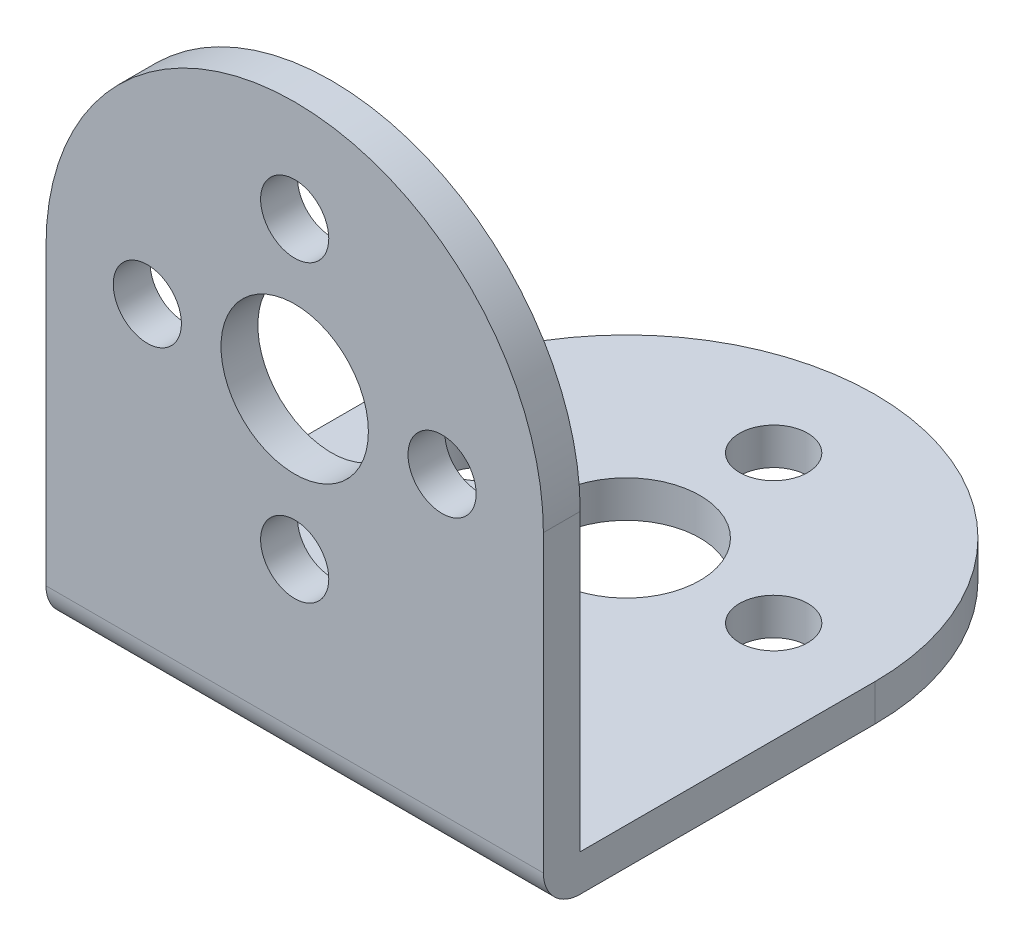
ISO-10303-21;
HEADER;
FILE_DESCRIPTION(('STEP AP214'),'2;1');
FILE_NAME('part.step','',(''),(''),'','','');
FILE_SCHEMA(('AUTOMOTIVE_DESIGN { 1 0 10303 214 1 1 1 1 }'));
ENDSEC;
DATA;
#1=APPLICATION_CONTEXT('core data for automotive mechanical design processes');
#2=APPLICATION_PROTOCOL_DEFINITION('international standard','automotive_design',2000,#1);
#3=PRODUCT_CONTEXT('',#1,'mechanical');
#4=PRODUCT('Part','Part','',(#3));
#5=PRODUCT_RELATED_PRODUCT_CATEGORY('part','',(#4));
#6=PRODUCT_DEFINITION_FORMATION('','',#4);
#7=PRODUCT_DEFINITION_CONTEXT('part definition',#1,'design');
#8=PRODUCT_DEFINITION('design','',#6,#7);
#9=PRODUCT_DEFINITION_SHAPE('','',#8);
#10=(LENGTH_UNIT() NAMED_UNIT(*) SI_UNIT(.MILLI.,.METRE.));
#11=(NAMED_UNIT(*) PLANE_ANGLE_UNIT() SI_UNIT($,.RADIAN.));
#12=(NAMED_UNIT(*) SI_UNIT($,.STERADIAN.) SOLID_ANGLE_UNIT());
#13=UNCERTAINTY_MEASURE_WITH_UNIT(LENGTH_MEASURE(1.E-05),#10,'distance_accuracy_value','');
#14=(GEOMETRIC_REPRESENTATION_CONTEXT(3) GLOBAL_UNCERTAINTY_ASSIGNED_CONTEXT((#13)) GLOBAL_UNIT_ASSIGNED_CONTEXT((#10,
#11,#12)) REPRESENTATION_CONTEXT('',''));
#15=CARTESIAN_POINT('',(0.,0.,0.));
#16=DIRECTION('',(0.,0.,1.));
#17=DIRECTION('',(1.,0.,0.));
#18=AXIS2_PLACEMENT_3D('',#15,#16,#17);
#19=CARTESIAN_POINT('',(0.,0.,-18.));
#20=DIRECTION('',(0.,1.,0.));
#21=DIRECTION('',(0.,0.,1.));
#22=AXIS2_PLACEMENT_3D('',#19,#20,#21);
#23=CYLINDRICAL_SURFACE('',#22,4.);
#24=CARTESIAN_POINT('',(0.,0.,-18.));
#25=DIRECTION('',(0.,1.,0.));
#26=DIRECTION('',(0.,0.,1.));
#27=AXIS2_PLACEMENT_3D('',#24,#25,#26);
#28=CIRCLE('',#27,4.);
#29=CARTESIAN_POINT('',(0.,0.,-14.));
#30=VERTEX_POINT('',#29);
#31=EDGE_CURVE('E20',#30,#30,#28,.T.);
#32=ORIENTED_EDGE('',*,*,#31,.F.);
#33=EDGE_LOOP('',(#32));
#34=FACE_BOUND('',#33,.T.);
#35=CARTESIAN_POINT('',(0.,2.,-18.));
#36=DIRECTION('',(0.,1.,0.));
#37=DIRECTION('',(0.,0.,1.));
#38=AXIS2_PLACEMENT_3D('',#35,#36,#37);
#39=CIRCLE('',#38,4.);
#40=CARTESIAN_POINT('',(0.,2.,-14.));
#41=VERTEX_POINT('',#40);
#42=EDGE_CURVE('E161',#41,#41,#39,.F.);
#43=ORIENTED_EDGE('',*,*,#42,.F.);
#44=EDGE_LOOP('',(#43));
#45=FACE_BOUND('',#44,.T.);
#46=ADVANCED_FACE('F17',(#34,#45),#23,.F.);
#47=CARTESIAN_POINT('',(0.,0.,-26.));
#48=DIRECTION('',(0.,1.,0.));
#49=DIRECTION('',(0.,0.,1.));
#50=AXIS2_PLACEMENT_3D('',#47,#48,#49);
#51=CYLINDRICAL_SURFACE('',#50,1.85);
#52=CARTESIAN_POINT('',(0.,0.,-26.));
#53=DIRECTION('',(0.,1.,0.));
#54=DIRECTION('',(0.,0.,1.));
#55=AXIS2_PLACEMENT_3D('',#52,#53,#54);
#56=CIRCLE('',#55,1.85);
#57=CARTESIAN_POINT('',(0.,0.,-24.15));
#58=VERTEX_POINT('',#57);
#59=EDGE_CURVE('E174',#58,#58,#56,.T.);
#60=ORIENTED_EDGE('',*,*,#59,.F.);
#61=EDGE_LOOP('',(#60));
#62=FACE_BOUND('',#61,.T.);
#63=CARTESIAN_POINT('',(0.,2.,-26.));
#64=DIRECTION('',(0.,1.,0.));
#65=DIRECTION('',(0.,0.,1.));
#66=AXIS2_PLACEMENT_3D('',#63,#64,#65);
#67=CIRCLE('',#66,1.85);
#68=CARTESIAN_POINT('',(0.,2.,-24.15));
#69=VERTEX_POINT('',#68);
#70=EDGE_CURVE('E158',#69,#69,#67,.F.);
#71=ORIENTED_EDGE('',*,*,#70,.F.);
#72=EDGE_LOOP('',(#71));
#73=FACE_BOUND('',#72,.T.);
#74=ADVANCED_FACE('F184',(#62,#73),#51,.F.);
#75=CARTESIAN_POINT('',(8.,0.,-18.));
#76=DIRECTION('',(0.,1.,0.));
#77=DIRECTION('',(0.,0.,1.));
#78=AXIS2_PLACEMENT_3D('',#75,#76,#77);
#79=CYLINDRICAL_SURFACE('',#78,1.85);
#80=CARTESIAN_POINT('',(8.,0.,-18.));
#81=DIRECTION('',(0.,1.,0.));
#82=DIRECTION('',(0.,0.,1.));
#83=AXIS2_PLACEMENT_3D('',#80,#81,#82);
#84=CIRCLE('',#83,1.85);
#85=CARTESIAN_POINT('',(8.,0.,-16.15));
#86=VERTEX_POINT('',#85);
#87=EDGE_CURVE('E172',#86,#86,#84,.T.);
#88=ORIENTED_EDGE('',*,*,#87,.F.);
#89=EDGE_LOOP('',(#88));
#90=FACE_BOUND('',#89,.T.);
#91=CARTESIAN_POINT('',(8.,2.,-18.));
#92=DIRECTION('',(0.,1.,0.));
#93=DIRECTION('',(0.,0.,1.));
#94=AXIS2_PLACEMENT_3D('',#91,#92,#93);
#95=CIRCLE('',#94,1.85);
#96=CARTESIAN_POINT('',(8.,2.,-16.15));
#97=VERTEX_POINT('',#96);
#98=EDGE_CURVE('E155',#97,#97,#95,.F.);
#99=ORIENTED_EDGE('',*,*,#98,.F.);
#100=EDGE_LOOP('',(#99));
#101=FACE_BOUND('',#100,.T.);
#102=ADVANCED_FACE('F366',(#90,#101),#79,.F.);
#103=CARTESIAN_POINT('',(0.,0.,-10.));
#104=DIRECTION('',(0.,1.,0.));
#105=DIRECTION('',(0.,0.,1.));
#106=AXIS2_PLACEMENT_3D('',#103,#104,#105);
#107=CYLINDRICAL_SURFACE('',#106,1.85);
#108=CARTESIAN_POINT('',(0.,0.,-10.));
#109=DIRECTION('',(0.,1.,0.));
#110=DIRECTION('',(0.,0.,1.));
#111=AXIS2_PLACEMENT_3D('',#108,#109,#110);
#112=CIRCLE('',#111,1.85);
#113=CARTESIAN_POINT('',(0.,0.,-8.15));
#114=VERTEX_POINT('',#113);
#115=EDGE_CURVE('E169',#114,#114,#112,.T.);
#116=ORIENTED_EDGE('',*,*,#115,.F.);
#117=EDGE_LOOP('',(#116));
#118=FACE_BOUND('',#117,.T.);
#119=CARTESIAN_POINT('',(0.,2.,-10.));
#120=DIRECTION('',(0.,1.,0.));
#121=DIRECTION('',(0.,0.,1.));
#122=AXIS2_PLACEMENT_3D('',#119,#120,#121);
#123=CIRCLE('',#122,1.85);
#124=CARTESIAN_POINT('',(0.,2.,-8.15));
#125=VERTEX_POINT('',#124);
#126=EDGE_CURVE('E152',#125,#125,#123,.F.);
#127=ORIENTED_EDGE('',*,*,#126,.F.);
#128=EDGE_LOOP('',(#127));
#129=FACE_BOUND('',#128,.T.);
#130=ADVANCED_FACE('F357',(#118,#129),#107,.F.);
#131=CARTESIAN_POINT('',(-8.,0.,-18.));
#132=DIRECTION('',(0.,1.,0.));
#133=DIRECTION('',(0.,0.,1.));
#134=AXIS2_PLACEMENT_3D('',#131,#132,#133);
#135=CYLINDRICAL_SURFACE('',#134,1.85);
#136=CARTESIAN_POINT('',(-8.,0.,-18.));
#137=DIRECTION('',(0.,1.,0.));
#138=DIRECTION('',(0.,0.,1.));
#139=AXIS2_PLACEMENT_3D('',#136,#137,#138);
#140=CIRCLE('',#139,1.85);
#141=CARTESIAN_POINT('',(-8.,0.,-16.15));
#142=VERTEX_POINT('',#141);
#143=EDGE_CURVE('E86',#142,#142,#140,.T.);
#144=ORIENTED_EDGE('',*,*,#143,.F.);
#145=EDGE_LOOP('',(#144));
#146=FACE_BOUND('',#145,.T.);
#147=CARTESIAN_POINT('',(-8.,2.,-18.));
#148=DIRECTION('',(0.,1.,0.));
#149=DIRECTION('',(0.,0.,1.));
#150=AXIS2_PLACEMENT_3D('',#147,#148,#149);
#151=CIRCLE('',#150,1.85);
#152=CARTESIAN_POINT('',(-8.,2.,-16.15));
#153=VERTEX_POINT('',#152);
#154=EDGE_CURVE('E149',#153,#153,#151,.F.);
#155=ORIENTED_EDGE('',*,*,#154,.F.);
#156=EDGE_LOOP('',(#155));
#157=FACE_BOUND('',#156,.T.);
#158=ADVANCED_FACE('F348',(#146,#157),#135,.F.);
#159=CARTESIAN_POINT('',(-13.5,0.,0.));
#160=DIRECTION('',(0.,-1.,0.));
#161=DIRECTION('',(0.,0.,-1.));
#162=AXIS2_PLACEMENT_3D('',#159,#160,#161);
#163=PLANE('',#162);
#164=ORIENTED_EDGE('',*,*,#143,.T.);
#165=EDGE_LOOP('',(#164));
#166=FACE_BOUND('',#165,.T.);
#167=ORIENTED_EDGE('',*,*,#115,.T.);
#168=EDGE_LOOP('',(#167));
#169=FACE_BOUND('',#168,.T.);
#170=ORIENTED_EDGE('',*,*,#87,.T.);
#171=EDGE_LOOP('',(#170));
#172=FACE_BOUND('',#171,.T.);
#173=ORIENTED_EDGE('',*,*,#59,.T.);
#174=EDGE_LOOP('',(#173));
#175=FACE_BOUND('',#174,.T.);
#176=ORIENTED_EDGE('',*,*,#31,.T.);
#177=EDGE_LOOP('',(#176));
#178=FACE_BOUND('',#177,.T.);
#179=CARTESIAN_POINT('',(0.,0.,-18.));
#180=DIRECTION('',(0.,1.,0.));
#181=DIRECTION('',(0.,0.,1.));
#182=AXIS2_PLACEMENT_3D('',#179,#180,#181);
#183=CIRCLE('',#182,13.5);
#184=CARTESIAN_POINT('',(13.5,0.,-18.));
#185=VERTEX_POINT('',#184);
#186=CARTESIAN_POINT('',(-13.5,0.,-18.));
#187=VERTEX_POINT('',#186);
#188=EDGE_CURVE('E75',#185,#187,#183,.T.);
#189=ORIENTED_EDGE('',*,*,#188,.F.);
#190=DIRECTION('',(0.,0.,-1.));
#191=VECTOR('',#190,1.);
#192=CARTESIAN_POINT('',(13.5,0.,0.));
#193=LINE('',#192,#191);
#194=CARTESIAN_POINT('',(13.5,0.,-2.));
#195=VERTEX_POINT('',#194);
#196=EDGE_CURVE('E79',#195,#185,#193,.T.);
#197=ORIENTED_EDGE('',*,*,#196,.F.);
#198=DIRECTION('',(-1.,0.,0.));
#199=VECTOR('',#198,1.);
#200=CARTESIAN_POINT('',(48.6972,0.,-2.));
#201=LINE('',#200,#199);
#202=CARTESIAN_POINT('',(-13.5,0.,-2.));
#203=VERTEX_POINT('',#202);
#204=EDGE_CURVE('E85',#203,#195,#201,.F.);
#205=ORIENTED_EDGE('',*,*,#204,.F.);
#206=DIRECTION('',(0.,0.,-1.));
#207=VECTOR('',#206,1.);
#208=CARTESIAN_POINT('',(-13.5,0.,0.));
#209=LINE('',#208,#207);
#210=EDGE_CURVE('E82',#203,#187,#209,.T.);
#211=ORIENTED_EDGE('',*,*,#210,.T.);
#212=EDGE_LOOP('',(#189,#197,#205,#211));
#213=FACE_BOUND('',#212,.T.);
#214=ADVANCED_FACE('F77',(#166,#169,#172,#175,#178,#213),#163,.T.);
#215=CARTESIAN_POINT('',(0.,-41.0634,-18.));
#216=DIRECTION('',(0.,1.,0.));
#217=DIRECTION('',(0.,0.,1.));
#218=AXIS2_PLACEMENT_3D('',#215,#216,#217);
#219=CYLINDRICAL_SURFACE('',#218,13.5);
#220=ORIENTED_EDGE('',*,*,#188,.T.);
#221=DIRECTION('',(0.,1.,0.));
#222=VECTOR('',#221,1.);
#223=CARTESIAN_POINT('',(-13.5,0.,-18.));
#224=LINE('',#223,#222);
#225=CARTESIAN_POINT('',(-13.5,2.,-18.));
#226=VERTEX_POINT('',#225);
#227=EDGE_CURVE('E112',#187,#226,#224,.T.);
#228=ORIENTED_EDGE('',*,*,#227,.T.);
#229=CARTESIAN_POINT('',(0.,2.,-18.));
#230=DIRECTION('',(0.,1.,0.));
#231=DIRECTION('',(0.,0.,1.));
#232=AXIS2_PLACEMENT_3D('',#229,#230,#231);
#233=CIRCLE('',#232,13.5);
#234=CARTESIAN_POINT('',(13.5,2.,-18.));
#235=VERTEX_POINT('',#234);
#236=EDGE_CURVE('E91',#235,#226,#233,.T.);
#237=ORIENTED_EDGE('',*,*,#236,.F.);
#238=DIRECTION('',(0.,1.,0.));
#239=VECTOR('',#238,1.);
#240=CARTESIAN_POINT('',(13.5,0.,-18.));
#241=LINE('',#240,#239);
#242=EDGE_CURVE('E89',#185,#235,#241,.T.);
#243=ORIENTED_EDGE('',*,*,#242,.F.);
#244=EDGE_LOOP('',(#220,#228,#237,#243));
#245=FACE_BOUND('',#244,.T.);
#246=ADVANCED_FACE('F90',(#245),#219,.T.);
#247=CARTESIAN_POINT('',(48.6972,2.,-2.));
#248=DIRECTION('',(-1.,0.,0.));
#249=DIRECTION('',(0.,0.,1.));
#250=AXIS2_PLACEMENT_3D('',#247,#248,#249);
#251=CYLINDRICAL_SURFACE('',#250,2.);
#252=CARTESIAN_POINT('',(13.5,2.,-2.));
#253=DIRECTION('',(-1.,0.,0.));
#254=DIRECTION('',(0.,0.,1.));
#255=AXIS2_PLACEMENT_3D('',#252,#253,#254);
#256=CIRCLE('',#255,2.);
#257=CARTESIAN_POINT('',(13.5,2.,0.));
#258=VERTEX_POINT('',#257);
#259=EDGE_CURVE('E99',#258,#195,#256,.F.);
#260=ORIENTED_EDGE('',*,*,#259,.F.);
#261=DIRECTION('',(1.,0.,0.));
#262=VECTOR('',#261,1.);
#263=CARTESIAN_POINT('',(-13.5,2.,0.));
#264=LINE('',#263,#262);
#265=CARTESIAN_POINT('',(-13.5,2.,0.));
#266=VERTEX_POINT('',#265);
#267=EDGE_CURVE('E109',#266,#258,#264,.T.);
#268=ORIENTED_EDGE('',*,*,#267,.F.);
#269=CARTESIAN_POINT('',(-13.5,2.,-2.));
#270=DIRECTION('',(-1.,0.,0.));
#271=DIRECTION('',(0.,0.,1.));
#272=AXIS2_PLACEMENT_3D('',#269,#270,#271);
#273=CIRCLE('',#272,2.);
#274=EDGE_CURVE('E145',#266,#203,#273,.F.);
#275=ORIENTED_EDGE('',*,*,#274,.T.);
#276=ORIENTED_EDGE('',*,*,#204,.T.);
#277=EDGE_LOOP('',(#260,#268,#275,#276));
#278=FACE_BOUND('',#277,.T.);
#279=ADVANCED_FACE('F219',(#278),#251,.T.);
#280=CARTESIAN_POINT('',(-13.5,31.5,0.));
#281=DIRECTION('',(0.,0.,1.));
#282=DIRECTION('',(1.,0.,0.));
#283=AXIS2_PLACEMENT_3D('',#280,#281,#282);
#284=PLANE('',#283);
#285=CARTESIAN_POINT('',(-8.,18.,0.));
#286=DIRECTION('',(0.,0.,1.));
#287=DIRECTION('',(1.,0.,0.));
#288=AXIS2_PLACEMENT_3D('',#285,#286,#287);
#289=CIRCLE('',#288,1.85);
#290=CARTESIAN_POINT('',(-6.15,18.,0.));
#291=VERTEX_POINT('',#290);
#292=EDGE_CURVE('E130',#291,#291,#289,.F.);
#293=ORIENTED_EDGE('',*,*,#292,.T.);
#294=EDGE_LOOP('',(#293));
#295=FACE_BOUND('',#294,.T.);
#296=CARTESIAN_POINT('',(0.,10.,0.));
#297=DIRECTION('',(0.,0.,1.));
#298=DIRECTION('',(1.,0.,0.));
#299=AXIS2_PLACEMENT_3D('',#296,#297,#298);
#300=CIRCLE('',#299,1.85);
#301=CARTESIAN_POINT('',(1.85,10.,0.));
#302=VERTEX_POINT('',#301);
#303=EDGE_CURVE('E133',#302,#302,#300,.F.);
#304=ORIENTED_EDGE('',*,*,#303,.T.);
#305=EDGE_LOOP('',(#304));
#306=FACE_BOUND('',#305,.T.);
#307=CARTESIAN_POINT('',(8.,18.,0.));
#308=DIRECTION('',(0.,0.,1.));
#309=DIRECTION('',(1.,0.,0.));
#310=AXIS2_PLACEMENT_3D('',#307,#308,#309);
#311=CIRCLE('',#310,1.85);
#312=CARTESIAN_POINT('',(9.85,18.,0.));
#313=VERTEX_POINT('',#312);
#314=EDGE_CURVE('E136',#313,#313,#311,.F.);
#315=ORIENTED_EDGE('',*,*,#314,.T.);
#316=EDGE_LOOP('',(#315));
#317=FACE_BOUND('',#316,.T.);
#318=CARTESIAN_POINT('',(0.,26.,0.));
#319=DIRECTION('',(0.,0.,1.));
#320=DIRECTION('',(1.,0.,0.));
#321=AXIS2_PLACEMENT_3D('',#318,#319,#320);
#322=CIRCLE('',#321,1.85);
#323=CARTESIAN_POINT('',(1.85,26.,0.));
#324=VERTEX_POINT('',#323);
#325=EDGE_CURVE('E139',#324,#324,#322,.F.);
#326=ORIENTED_EDGE('',*,*,#325,.T.);
#327=EDGE_LOOP('',(#326));
#328=FACE_BOUND('',#327,.T.);
#329=CARTESIAN_POINT('',(0.,18.,0.));
#330=DIRECTION('',(0.,0.,1.));
#331=DIRECTION('',(1.,0.,0.));
#332=AXIS2_PLACEMENT_3D('',#329,#330,#331);
#333=CIRCLE('',#332,4.);
#334=CARTESIAN_POINT('',(4.,18.,0.));
#335=VERTEX_POINT('',#334);
#336=EDGE_CURVE('E142',#335,#335,#333,.F.);
#337=ORIENTED_EDGE('',*,*,#336,.T.);
#338=EDGE_LOOP('',(#337));
#339=FACE_BOUND('',#338,.T.);
#340=CARTESIAN_POINT('',(0.,18.,0.));
#341=DIRECTION('',(0.,0.,1.));
#342=DIRECTION('',(1.,0.,0.));
#343=AXIS2_PLACEMENT_3D('',#340,#341,#342);
#344=CIRCLE('',#343,13.5);
#345=CARTESIAN_POINT('',(-13.5,18.,0.));
#346=VERTEX_POINT('',#345);
#347=CARTESIAN_POINT('',(13.5,18.,0.));
#348=VERTEX_POINT('',#347);
#349=EDGE_CURVE('E101',#346,#348,#344,.F.);
#350=ORIENTED_EDGE('',*,*,#349,.F.);
#351=DIRECTION('',(0.,1.,0.));
#352=VECTOR('',#351,1.);
#353=CARTESIAN_POINT('',(-13.5,0.,0.));
#354=LINE('',#353,#352);
#355=EDGE_CURVE('E148',#346,#266,#354,.F.);
#356=ORIENTED_EDGE('',*,*,#355,.T.);
#357=ORIENTED_EDGE('',*,*,#267,.T.);
#358=DIRECTION('',(0.,1.,0.));
#359=VECTOR('',#358,1.);
#360=CARTESIAN_POINT('',(13.5,0.,0.));
#361=LINE('',#360,#359);
#362=EDGE_CURVE('E105',#348,#258,#361,.F.);
#363=ORIENTED_EDGE('',*,*,#362,.F.);
#364=EDGE_LOOP('',(#350,#356,#357,#363));
#365=FACE_BOUND('',#364,.T.);
#366=ADVANCED_FACE('F217',(#295,#306,#317,#328,#339,#365),#284,.T.);
#367=CARTESIAN_POINT('',(0.,18.,-72.5634));
#368=DIRECTION('',(0.,0.,1.));
#369=DIRECTION('',(1.,0.,0.));
#370=AXIS2_PLACEMENT_3D('',#367,#368,#369);
#371=CYLINDRICAL_SURFACE('',#370,13.5);
#372=CARTESIAN_POINT('',(0.,18.,-2.));
#373=DIRECTION('',(0.,0.,1.));
#374=DIRECTION('',(1.,0.,0.));
#375=AXIS2_PLACEMENT_3D('',#372,#373,#374);
#376=CIRCLE('',#375,13.5);
#377=CARTESIAN_POINT('',(-13.5,18.,-2.));
#378=VERTEX_POINT('',#377);
#379=CARTESIAN_POINT('',(13.5,18.,-2.));
#380=VERTEX_POINT('',#379);
#381=EDGE_CURVE('E126',#378,#380,#376,.F.);
#382=ORIENTED_EDGE('',*,*,#381,.F.);
#383=DIRECTION('',(0.,0.,-1.));
#384=VECTOR('',#383,1.);
#385=CARTESIAN_POINT('',(-13.5,18.,0.));
#386=LINE('',#385,#384);
#387=EDGE_CURVE('E205',#378,#346,#386,.F.);
#388=ORIENTED_EDGE('',*,*,#387,.T.);
#389=ORIENTED_EDGE('',*,*,#349,.T.);
#390=DIRECTION('',(0.,0.,-1.));
#391=VECTOR('',#390,1.);
#392=CARTESIAN_POINT('',(13.5,18.,0.));
#393=LINE('',#392,#391);
#394=EDGE_CURVE('E94',#380,#348,#393,.F.);
#395=ORIENTED_EDGE('',*,*,#394,.F.);
#396=EDGE_LOOP('',(#382,#388,#389,#395));
#397=FACE_BOUND('',#396,.T.);
#398=ADVANCED_FACE('F212',(#397),#371,.T.);
#399=CARTESIAN_POINT('',(13.5,0.,0.));
#400=DIRECTION('',(1.,0.,0.));
#401=DIRECTION('',(0.,0.,-1.));
#402=AXIS2_PLACEMENT_3D('',#399,#400,#401);
#403=PLANE('',#402);
#404=ORIENTED_EDGE('',*,*,#394,.T.);
#405=ORIENTED_EDGE('',*,*,#362,.T.);
#406=ORIENTED_EDGE('',*,*,#259,.T.);
#407=ORIENTED_EDGE('',*,*,#196,.T.);
#408=ORIENTED_EDGE('',*,*,#242,.T.);
#409=DIRECTION('',(0.,0.,1.));
#410=VECTOR('',#409,1.);
#411=CARTESIAN_POINT('',(13.5,2.,-31.5));
#412=LINE('',#411,#410);
#413=CARTESIAN_POINT('',(13.5,2.,-2.));
#414=VERTEX_POINT('',#413);
#415=EDGE_CURVE('E164',#414,#235,#412,.F.);
#416=ORIENTED_EDGE('',*,*,#415,.F.);
#417=DIRECTION('',(0.,1.,0.));
#418=VECTOR('',#417,1.);
#419=CARTESIAN_POINT('',(13.5,2.,-2.));
#420=LINE('',#419,#418);
#421=EDGE_CURVE('E129',#380,#414,#420,.F.);
#422=ORIENTED_EDGE('',*,*,#421,.F.);
#423=EDGE_LOOP('',(#404,#405,#406,#407,#408,#416,#422));
#424=FACE_BOUND('',#423,.T.);
#425=ADVANCED_FACE('F97',(#424),#403,.T.);
#426=CARTESIAN_POINT('',(-13.5,2.,-31.5));
#427=DIRECTION('',(0.,1.,0.));
#428=DIRECTION('',(0.,0.,1.));
#429=AXIS2_PLACEMENT_3D('',#426,#427,#428);
#430=PLANE('',#429);
#431=ORIENTED_EDGE('',*,*,#154,.T.);
#432=EDGE_LOOP('',(#431));
#433=FACE_BOUND('',#432,.T.);
#434=ORIENTED_EDGE('',*,*,#126,.T.);
#435=EDGE_LOOP('',(#434));
#436=FACE_BOUND('',#435,.T.);
#437=ORIENTED_EDGE('',*,*,#98,.T.);
#438=EDGE_LOOP('',(#437));
#439=FACE_BOUND('',#438,.T.);
#440=ORIENTED_EDGE('',*,*,#70,.T.);
#441=EDGE_LOOP('',(#440));
#442=FACE_BOUND('',#441,.T.);
#443=ORIENTED_EDGE('',*,*,#42,.T.);
#444=EDGE_LOOP('',(#443));
#445=FACE_BOUND('',#444,.T.);
#446=DIRECTION('',(-1.,0.,0.));
#447=VECTOR('',#446,1.);
#448=CARTESIAN_POINT('',(-13.5,2.,-2.));
#449=LINE('',#448,#447);
#450=CARTESIAN_POINT('',(-13.5,2.,-2.));
#451=VERTEX_POINT('',#450);
#452=EDGE_CURVE('E193',#414,#451,#449,.T.);
#453=ORIENTED_EDGE('',*,*,#452,.F.);
#454=ORIENTED_EDGE('',*,*,#415,.T.);
#455=ORIENTED_EDGE('',*,*,#236,.T.);
#456=DIRECTION('',(0.,0.,-1.));
#457=VECTOR('',#456,1.);
#458=CARTESIAN_POINT('',(-13.5,2.,0.));
#459=LINE('',#458,#457);
#460=EDGE_CURVE('E35',#226,#451,#459,.F.);
#461=ORIENTED_EDGE('',*,*,#460,.T.);
#462=EDGE_LOOP('',(#453,#454,#455,#461));
#463=FACE_BOUND('',#462,.T.);
#464=ADVANCED_FACE('F187',(#433,#436,#439,#442,#445,#463),#430,.T.);
#465=CARTESIAN_POINT('',(-13.5,0.,0.));
#466=DIRECTION('',(1.,0.,0.));
#467=DIRECTION('',(0.,0.,-1.));
#468=AXIS2_PLACEMENT_3D('',#465,#466,#467);
#469=PLANE('',#468);
#470=ORIENTED_EDGE('',*,*,#355,.F.);
#471=ORIENTED_EDGE('',*,*,#387,.F.);
#472=DIRECTION('',(0.,1.,0.));
#473=VECTOR('',#472,1.);
#474=CARTESIAN_POINT('',(-13.5,2.,-2.));
#475=LINE('',#474,#473);
#476=EDGE_CURVE('E125',#451,#378,#475,.T.);
#477=ORIENTED_EDGE('',*,*,#476,.F.);
#478=ORIENTED_EDGE('',*,*,#460,.F.);
#479=ORIENTED_EDGE('',*,*,#227,.F.);
#480=ORIENTED_EDGE('',*,*,#210,.F.);
#481=ORIENTED_EDGE('',*,*,#274,.F.);
#482=EDGE_LOOP('',(#470,#471,#477,#478,#479,#480,#481));
#483=FACE_BOUND('',#482,.T.);
#484=ADVANCED_FACE('F189',(#483),#469,.F.);
#485=CARTESIAN_POINT('',(0.,18.,0.));
#486=DIRECTION('',(0.,0.,1.));
#487=DIRECTION('',(1.,0.,0.));
#488=AXIS2_PLACEMENT_3D('',#485,#486,#487);
#489=CYLINDRICAL_SURFACE('',#488,4.);
#490=CARTESIAN_POINT('',(0.,18.,-2.));
#491=DIRECTION('',(0.,0.,1.));
#492=DIRECTION('',(1.,0.,0.));
#493=AXIS2_PLACEMENT_3D('',#490,#491,#492);
#494=CIRCLE('',#493,4.);
#495=CARTESIAN_POINT('',(4.,18.,-2.));
#496=VERTEX_POINT('',#495);
#497=EDGE_CURVE('E122',#496,#496,#494,.T.);
#498=ORIENTED_EDGE('',*,*,#497,.F.);
#499=EDGE_LOOP('',(#498));
#500=FACE_BOUND('',#499,.T.);
#501=ORIENTED_EDGE('',*,*,#336,.F.);
#502=EDGE_LOOP('',(#501));
#503=FACE_BOUND('',#502,.T.);
#504=ADVANCED_FACE('F252',(#500,#503),#489,.F.);
#505=CARTESIAN_POINT('',(0.,26.,0.));
#506=DIRECTION('',(0.,0.,1.));
#507=DIRECTION('',(1.,0.,0.));
#508=AXIS2_PLACEMENT_3D('',#505,#506,#507);
#509=CYLINDRICAL_SURFACE('',#508,1.85);
#510=CARTESIAN_POINT('',(0.,26.,-2.));
#511=DIRECTION('',(0.,0.,1.));
#512=DIRECTION('',(1.,0.,0.));
#513=AXIS2_PLACEMENT_3D('',#510,#511,#512);
#514=CIRCLE('',#513,1.85);
#515=CARTESIAN_POINT('',(1.85,26.,-2.));
#516=VERTEX_POINT('',#515);
#517=EDGE_CURVE('E119',#516,#516,#514,.T.);
#518=ORIENTED_EDGE('',*,*,#517,.F.);
#519=EDGE_LOOP('',(#518));
#520=FACE_BOUND('',#519,.T.);
#521=ORIENTED_EDGE('',*,*,#325,.F.);
#522=EDGE_LOOP('',(#521));
#523=FACE_BOUND('',#522,.T.);
#524=ADVANCED_FACE('F248',(#520,#523),#509,.F.);
#525=CARTESIAN_POINT('',(8.,18.,0.));
#526=DIRECTION('',(0.,0.,1.));
#527=DIRECTION('',(1.,0.,0.));
#528=AXIS2_PLACEMENT_3D('',#525,#526,#527);
#529=CYLINDRICAL_SURFACE('',#528,1.85);
#530=CARTESIAN_POINT('',(8.,18.,-2.));
#531=DIRECTION('',(0.,0.,1.));
#532=DIRECTION('',(1.,0.,0.));
#533=AXIS2_PLACEMENT_3D('',#530,#531,#532);
#534=CIRCLE('',#533,1.85);
#535=CARTESIAN_POINT('',(9.85,18.,-2.));
#536=VERTEX_POINT('',#535);
#537=EDGE_CURVE('E116',#536,#536,#534,.T.);
#538=ORIENTED_EDGE('',*,*,#537,.F.);
#539=EDGE_LOOP('',(#538));
#540=FACE_BOUND('',#539,.T.);
#541=ORIENTED_EDGE('',*,*,#314,.F.);
#542=EDGE_LOOP('',(#541));
#543=FACE_BOUND('',#542,.T.);
#544=ADVANCED_FACE('F244',(#540,#543),#529,.F.);
#545=CARTESIAN_POINT('',(0.,10.,0.));
#546=DIRECTION('',(0.,0.,1.));
#547=DIRECTION('',(1.,0.,0.));
#548=AXIS2_PLACEMENT_3D('',#545,#546,#547);
#549=CYLINDRICAL_SURFACE('',#548,1.85);
#550=CARTESIAN_POINT('',(0.,10.,-2.));
#551=DIRECTION('',(0.,0.,1.));
#552=DIRECTION('',(1.,0.,0.));
#553=AXIS2_PLACEMENT_3D('',#550,#551,#552);
#554=CIRCLE('',#553,1.85);
#555=CARTESIAN_POINT('',(1.85,10.,-2.));
#556=VERTEX_POINT('',#555);
#557=EDGE_CURVE('E26',#556,#556,#554,.T.);
#558=ORIENTED_EDGE('',*,*,#557,.F.);
#559=EDGE_LOOP('',(#558));
#560=FACE_BOUND('',#559,.T.);
#561=ORIENTED_EDGE('',*,*,#303,.F.);
#562=EDGE_LOOP('',(#561));
#563=FACE_BOUND('',#562,.T.);
#564=ADVANCED_FACE('F237',(#560,#563),#549,.F.);
#565=CARTESIAN_POINT('',(-8.,18.,0.));
#566=DIRECTION('',(0.,0.,1.));
#567=DIRECTION('',(1.,0.,0.));
#568=AXIS2_PLACEMENT_3D('',#565,#566,#567);
#569=CYLINDRICAL_SURFACE('',#568,1.85);
#570=CARTESIAN_POINT('',(-8.,18.,-2.));
#571=DIRECTION('',(0.,0.,1.));
#572=DIRECTION('',(1.,0.,0.));
#573=AXIS2_PLACEMENT_3D('',#570,#571,#572);
#574=CIRCLE('',#573,1.85);
#575=CARTESIAN_POINT('',(-6.15,18.,-2.));
#576=VERTEX_POINT('',#575);
#577=EDGE_CURVE('E10',#576,#576,#574,.T.);
#578=ORIENTED_EDGE('',*,*,#577,.F.);
#579=EDGE_LOOP('',(#578));
#580=FACE_BOUND('',#579,.T.);
#581=ORIENTED_EDGE('',*,*,#292,.F.);
#582=EDGE_LOOP('',(#581));
#583=FACE_BOUND('',#582,.T.);
#584=ADVANCED_FACE('F231',(#580,#583),#569,.F.);
#585=CARTESIAN_POINT('',(-13.5,2.,-2.));
#586=DIRECTION('',(0.,0.,-1.));
#587=DIRECTION('',(-1.,0.,0.));
#588=AXIS2_PLACEMENT_3D('',#585,#586,#587);
#589=PLANE('',#588);
#590=ORIENTED_EDGE('',*,*,#577,.T.);
#591=EDGE_LOOP('',(#590));
#592=FACE_BOUND('',#591,.T.);
#593=ORIENTED_EDGE('',*,*,#557,.T.);
#594=EDGE_LOOP('',(#593));
#595=FACE_BOUND('',#594,.T.);
#596=ORIENTED_EDGE('',*,*,#537,.T.);
#597=EDGE_LOOP('',(#596));
#598=FACE_BOUND('',#597,.T.);
#599=ORIENTED_EDGE('',*,*,#517,.T.);
#600=EDGE_LOOP('',(#599));
#601=FACE_BOUND('',#600,.T.);
#602=ORIENTED_EDGE('',*,*,#497,.T.);
#603=EDGE_LOOP('',(#602));
#604=FACE_BOUND('',#603,.T.);
#605=ORIENTED_EDGE('',*,*,#452,.T.);
#606=ORIENTED_EDGE('',*,*,#476,.T.);
#607=ORIENTED_EDGE('',*,*,#381,.T.);
#608=ORIENTED_EDGE('',*,*,#421,.T.);
#609=EDGE_LOOP('',(#605,#606,#607,#608));
#610=FACE_BOUND('',#609,.T.);
#611=ADVANCED_FACE('F199',(#592,#595,#598,#601,#604,#610),#589,.T.);
#612=CLOSED_SHELL('',(#46,#74,#102,#130,#158,#214,#246,#279,#366,#398,#425,#464,#484,#504,#524,
#544,#564,#584,#611));
#613=MANIFOLD_SOLID_BREP('B1',#612);
#614=ADVANCED_BREP_SHAPE_REPRESENTATION('',(#18,#613),#14);
#615=SHAPE_DEFINITION_REPRESENTATION(#9,#614);
ENDSEC;
END-ISO-10303-21;
